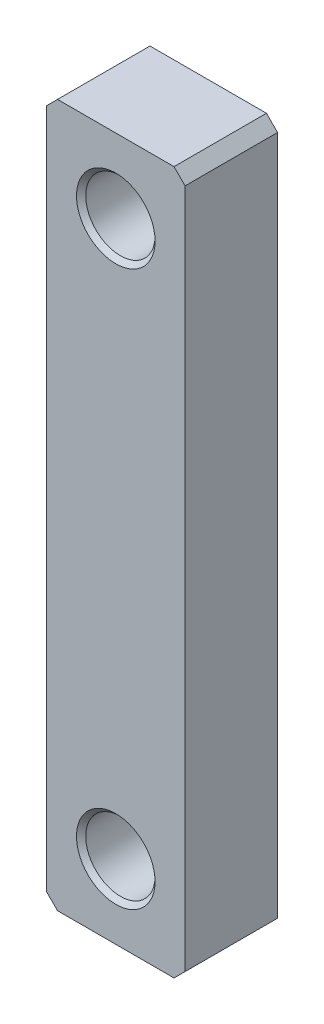
ISO-10303-21;
HEADER;
FILE_DESCRIPTION(('STEP AP214'),'2;1');
FILE_NAME('part.step','',(''),(''),'','','');
FILE_SCHEMA(('AUTOMOTIVE_DESIGN { 1 0 10303 214 1 1 1 1 }'));
ENDSEC;
DATA;
#1=APPLICATION_CONTEXT('core data for automotive mechanical design processes');
#2=APPLICATION_PROTOCOL_DEFINITION('international standard','automotive_design',2000,#1);
#3=PRODUCT_CONTEXT('',#1,'mechanical');
#4=PRODUCT('Part','Part','',(#3));
#5=PRODUCT_RELATED_PRODUCT_CATEGORY('part','',(#4));
#6=PRODUCT_DEFINITION_FORMATION('','',#4);
#7=PRODUCT_DEFINITION_CONTEXT('part definition',#1,'design');
#8=PRODUCT_DEFINITION('design','',#6,#7);
#9=PRODUCT_DEFINITION_SHAPE('','',#8);
#10=(LENGTH_UNIT() NAMED_UNIT(*) SI_UNIT(.MILLI.,.METRE.));
#11=(NAMED_UNIT(*) PLANE_ANGLE_UNIT() SI_UNIT($,.RADIAN.));
#12=(NAMED_UNIT(*) SI_UNIT($,.STERADIAN.) SOLID_ANGLE_UNIT());
#13=UNCERTAINTY_MEASURE_WITH_UNIT(LENGTH_MEASURE(1.E-05),#10,'distance_accuracy_value','');
#14=(GEOMETRIC_REPRESENTATION_CONTEXT(3) GLOBAL_UNCERTAINTY_ASSIGNED_CONTEXT((#13)) GLOBAL_UNIT_ASSIGNED_CONTEXT((#10,
#11,#12)) REPRESENTATION_CONTEXT('',''));
#15=CARTESIAN_POINT('',(0.,0.,0.));
#16=DIRECTION('',(0.,0.,1.));
#17=DIRECTION('',(1.,0.,0.));
#18=AXIS2_PLACEMENT_3D('',#15,#16,#17);
#19=CARTESIAN_POINT('',(-9.52500000000001,48.26,-12.7));
#20=DIRECTION('',(-1.,0.,0.));
#21=DIRECTION('',(0.,-1.,0.));
#22=AXIS2_PLACEMENT_3D('',#19,#20,#21);
#23=PLANE('',#22);
#24=DIRECTION('',(0.,-1.,0.));
#25=VECTOR('',#24,1.);
#26=CARTESIAN_POINT('',(-9.52500000000001,48.26,-12.7));
#27=LINE('',#26,#25);
#28=CARTESIAN_POINT('',(-9.52500000000001,46.736,-12.7));
#29=VERTEX_POINT('',#28);
#30=CARTESIAN_POINT('',(-9.52500000000001,-46.736,-12.7));
#31=VERTEX_POINT('',#30);
#32=EDGE_CURVE('E170',#29,#31,#27,.T.);
#33=ORIENTED_EDGE('',*,*,#32,.T.);
#34=DIRECTION('',(0.,0.,1.));
#35=VECTOR('',#34,1.);
#36=CARTESIAN_POINT('',(-9.525,-46.736,-12.7));
#37=LINE('',#36,#35);
#38=CARTESIAN_POINT('',(-9.52500000000001,-46.736,0.));
#39=VERTEX_POINT('',#38);
#40=EDGE_CURVE('E166',#31,#39,#37,.T.);
#41=ORIENTED_EDGE('',*,*,#40,.T.);
#42=DIRECTION('',(0.,-1.,0.));
#43=VECTOR('',#42,1.);
#44=CARTESIAN_POINT('',(-9.52500000000001,48.26,0.));
#45=LINE('',#44,#43);
#46=CARTESIAN_POINT('',(-9.52500000000001,46.736,0.));
#47=VERTEX_POINT('',#46);
#48=EDGE_CURVE('E119',#47,#39,#45,.T.);
#49=ORIENTED_EDGE('',*,*,#48,.F.);
#50=DIRECTION('',(0.,0.,-1.));
#51=VECTOR('',#50,1.);
#52=CARTESIAN_POINT('',(-9.52500000000001,46.736,-12.7));
#53=LINE('',#52,#51);
#54=EDGE_CURVE('E164',#47,#29,#53,.T.);
#55=ORIENTED_EDGE('',*,*,#54,.T.);
#56=EDGE_LOOP('',(#33,#41,#49,#55));
#57=FACE_BOUND('',#56,.T.);
#58=ADVANCED_FACE('F48',(#57),#23,.T.);
#59=CARTESIAN_POINT('',(-9.52500000000001,48.26,-12.7));
#60=DIRECTION('',(0.,1.,0.));
#61=DIRECTION('',(0.,0.,1.));
#62=AXIS2_PLACEMENT_3D('',#59,#60,#61);
#63=PLANE('',#62);
#64=DIRECTION('',(-1.,0.,0.));
#65=VECTOR('',#64,1.);
#66=CARTESIAN_POINT('',(-9.52500000000001,48.26,-12.7));
#67=LINE('',#66,#65);
#68=CARTESIAN_POINT('',(8.00099999999999,48.26,-12.7));
#69=VERTEX_POINT('',#68);
#70=CARTESIAN_POINT('',(-8.00100000000002,48.26,-12.7));
#71=VERTEX_POINT('',#70);
#72=EDGE_CURVE('E140',#69,#71,#67,.T.);
#73=ORIENTED_EDGE('',*,*,#72,.T.);
#74=DIRECTION('',(0.,0.,1.));
#75=VECTOR('',#74,1.);
#76=CARTESIAN_POINT('',(-8.00100000000002,48.26,-12.7));
#77=LINE('',#76,#75);
#78=CARTESIAN_POINT('',(-8.00100000000001,48.26,0.));
#79=VERTEX_POINT('',#78);
#80=EDGE_CURVE('E13',#71,#79,#77,.T.);
#81=ORIENTED_EDGE('',*,*,#80,.T.);
#82=DIRECTION('',(-1.,0.,0.));
#83=VECTOR('',#82,1.);
#84=CARTESIAN_POINT('',(-9.52500000000001,48.26,0.));
#85=LINE('',#84,#83);
#86=CARTESIAN_POINT('',(8.00099999999998,48.26,0.));
#87=VERTEX_POINT('',#86);
#88=EDGE_CURVE('E172',#87,#79,#85,.T.);
#89=ORIENTED_EDGE('',*,*,#88,.F.);
#90=DIRECTION('',(0.,0.,-1.));
#91=VECTOR('',#90,1.);
#92=CARTESIAN_POINT('',(8.00099999999999,48.26,-12.7));
#93=LINE('',#92,#91);
#94=EDGE_CURVE('E56',#87,#69,#93,.T.);
#95=ORIENTED_EDGE('',*,*,#94,.T.);
#96=EDGE_LOOP('',(#73,#81,#89,#95));
#97=FACE_BOUND('',#96,.T.);
#98=ADVANCED_FACE('F222',(#97),#63,.T.);
#99=CARTESIAN_POINT('',(9.52499999999999,48.26,-12.7));
#100=DIRECTION('',(1.,0.,0.));
#101=DIRECTION('',(0.,1.,0.));
#102=AXIS2_PLACEMENT_3D('',#99,#100,#101);
#103=PLANE('',#102);
#104=DIRECTION('',(0.,1.,0.));
#105=VECTOR('',#104,1.);
#106=CARTESIAN_POINT('',(9.52499999999999,48.26,0.));
#107=LINE('',#106,#105);
#108=CARTESIAN_POINT('',(9.525,-46.736,0.));
#109=VERTEX_POINT('',#108);
#110=CARTESIAN_POINT('',(9.52499999999998,46.736,0.));
#111=VERTEX_POINT('',#110);
#112=EDGE_CURVE('E135',#109,#111,#107,.T.);
#113=ORIENTED_EDGE('',*,*,#112,.F.);
#114=DIRECTION('',(0.,0.,-1.));
#115=VECTOR('',#114,1.);
#116=CARTESIAN_POINT('',(9.525,-46.736,-12.7));
#117=LINE('',#116,#115);
#118=CARTESIAN_POINT('',(9.525,-46.736,-12.7));
#119=VERTEX_POINT('',#118);
#120=EDGE_CURVE('E156',#109,#119,#117,.T.);
#121=ORIENTED_EDGE('',*,*,#120,.T.);
#122=DIRECTION('',(0.,1.,0.));
#123=VECTOR('',#122,1.);
#124=CARTESIAN_POINT('',(9.52499999999999,48.26,-12.7));
#125=LINE('',#124,#123);
#126=CARTESIAN_POINT('',(9.52499999999999,46.736,-12.7));
#127=VERTEX_POINT('',#126);
#128=EDGE_CURVE('E144',#119,#127,#125,.T.);
#129=ORIENTED_EDGE('',*,*,#128,.T.);
#130=DIRECTION('',(0.,0.,1.));
#131=VECTOR('',#130,1.);
#132=CARTESIAN_POINT('',(9.52499999999999,46.736,-12.7));
#133=LINE('',#132,#131);
#134=EDGE_CURVE('E153',#127,#111,#133,.T.);
#135=ORIENTED_EDGE('',*,*,#134,.T.);
#136=EDGE_LOOP('',(#113,#121,#129,#135));
#137=FACE_BOUND('',#136,.T.);
#138=ADVANCED_FACE('F227',(#137),#103,.T.);
#139=CARTESIAN_POINT('',(-9.525,-48.26,-12.7));
#140=DIRECTION('',(0.,-1.,0.));
#141=DIRECTION('',(0.,0.,-1.));
#142=AXIS2_PLACEMENT_3D('',#139,#140,#141);
#143=PLANE('',#142);
#144=DIRECTION('',(1.,0.,0.));
#145=VECTOR('',#144,1.);
#146=CARTESIAN_POINT('',(-9.525,-48.26,-12.7));
#147=LINE('',#146,#145);
#148=CARTESIAN_POINT('',(-8.001,-48.26,-12.7));
#149=VERTEX_POINT('',#148);
#150=CARTESIAN_POINT('',(8.001,-48.26,-12.7));
#151=VERTEX_POINT('',#150);
#152=EDGE_CURVE('E171',#149,#151,#147,.T.);
#153=ORIENTED_EDGE('',*,*,#152,.T.);
#154=DIRECTION('',(0.,0.,1.));
#155=VECTOR('',#154,1.);
#156=CARTESIAN_POINT('',(8.001,-48.26,-12.7));
#157=LINE('',#156,#155);
#158=CARTESIAN_POINT('',(8.00100000000001,-48.26,0.));
#159=VERTEX_POINT('',#158);
#160=EDGE_CURVE('E134',#151,#159,#157,.T.);
#161=ORIENTED_EDGE('',*,*,#160,.T.);
#162=DIRECTION('',(1.,0.,0.));
#163=VECTOR('',#162,1.);
#164=CARTESIAN_POINT('',(-9.525,-48.26,0.));
#165=LINE('',#164,#163);
#166=CARTESIAN_POINT('',(-8.001,-48.26,0.));
#167=VERTEX_POINT('',#166);
#168=EDGE_CURVE('E117',#167,#159,#165,.T.);
#169=ORIENTED_EDGE('',*,*,#168,.F.);
#170=DIRECTION('',(0.,0.,-1.));
#171=VECTOR('',#170,1.);
#172=CARTESIAN_POINT('',(-8.001,-48.26,-12.7));
#173=LINE('',#172,#171);
#174=EDGE_CURVE('E131',#167,#149,#173,.T.);
#175=ORIENTED_EDGE('',*,*,#174,.T.);
#176=EDGE_LOOP('',(#153,#161,#169,#175));
#177=FACE_BOUND('',#176,.T.);
#178=ADVANCED_FACE('F130',(#177),#143,.T.);
#179=CARTESIAN_POINT('',(0.,0.,-12.7));
#180=DIRECTION('',(0.,0.,1.));
#181=DIRECTION('',(1.,0.,0.));
#182=AXIS2_PLACEMENT_3D('',#179,#180,#181);
#183=PLANE('',#182);
#184=CARTESIAN_POINT('',(0.,-38.1,-12.7));
#185=DIRECTION('',(0.,0.,1.));
#186=DIRECTION('',(1.,0.,0.));
#187=AXIS2_PLACEMENT_3D('',#184,#185,#186);
#188=CIRCLE('',#187,4.76249999999999);
#189=CARTESIAN_POINT('',(4.76249999999999,-38.1,-12.7));
#190=VERTEX_POINT('',#189);
#191=EDGE_CURVE('E147',#190,#190,#188,.T.);
#192=ORIENTED_EDGE('',*,*,#191,.T.);
#193=EDGE_LOOP('',(#192));
#194=FACE_BOUND('',#193,.T.);
#195=CARTESIAN_POINT('',(0.,38.1,-12.7));
#196=DIRECTION('',(0.,0.,1.));
#197=DIRECTION('',(1.,0.,0.));
#198=AXIS2_PLACEMENT_3D('',#195,#196,#197);
#199=CIRCLE('',#198,4.76249999999999);
#200=CARTESIAN_POINT('',(4.76249999999999,38.1,-12.7));
#201=VERTEX_POINT('',#200);
#202=EDGE_CURVE('E183',#201,#201,#199,.T.);
#203=ORIENTED_EDGE('',*,*,#202,.T.);
#204=EDGE_LOOP('',(#203));
#205=FACE_BOUND('',#204,.T.);
#206=ORIENTED_EDGE('',*,*,#128,.F.);
#207=DIRECTION('',(0.707106781186547,0.707106781186548,0.));
#208=VECTOR('',#207,1.);
#209=CARTESIAN_POINT('',(8.001,-48.26,-12.7));
#210=LINE('',#209,#208);
#211=EDGE_CURVE('E162',#119,#151,#210,.F.);
#212=ORIENTED_EDGE('',*,*,#211,.T.);
#213=ORIENTED_EDGE('',*,*,#152,.F.);
#214=DIRECTION('',(0.707106781186548,-0.707106781186548,0.));
#215=VECTOR('',#214,1.);
#216=CARTESIAN_POINT('',(-9.525,-46.736,-12.7));
#217=LINE('',#216,#215);
#218=EDGE_CURVE('E139',#149,#31,#217,.F.);
#219=ORIENTED_EDGE('',*,*,#218,.T.);
#220=ORIENTED_EDGE('',*,*,#32,.F.);
#221=DIRECTION('',(-0.707106781186548,-0.707106781186548,0.));
#222=VECTOR('',#221,1.);
#223=CARTESIAN_POINT('',(-8.00100000000002,48.26,-12.7));
#224=LINE('',#223,#222);
#225=EDGE_CURVE('E63',#29,#71,#224,.F.);
#226=ORIENTED_EDGE('',*,*,#225,.T.);
#227=ORIENTED_EDGE('',*,*,#72,.F.);
#228=DIRECTION('',(-0.707106781186548,0.707106781186548,0.));
#229=VECTOR('',#228,1.);
#230=CARTESIAN_POINT('',(9.52499999999999,46.736,-12.7));
#231=LINE('',#230,#229);
#232=EDGE_CURVE('E158',#69,#127,#231,.F.);
#233=ORIENTED_EDGE('',*,*,#232,.T.);
#234=EDGE_LOOP('',(#206,#212,#213,#219,#220,#226,#227,#233));
#235=FACE_BOUND('',#234,.T.);
#236=ADVANCED_FACE('F210',(#194,#205,#235),#183,.F.);
#237=CARTESIAN_POINT('',(0.,0.,0.));
#238=DIRECTION('',(0.,0.,1.));
#239=DIRECTION('',(1.,0.,0.));
#240=AXIS2_PLACEMENT_3D('',#237,#238,#239);
#241=PLANE('',#240);
#242=CARTESIAN_POINT('',(0.,-38.1,0.));
#243=DIRECTION('',(0.,0.,1.));
#244=DIRECTION('',(1.,0.,0.));
#245=AXIS2_PLACEMENT_3D('',#242,#243,#244);
#246=CIRCLE('',#245,5.3975);
#247=CARTESIAN_POINT('',(5.3975,-38.1,0.));
#248=VERTEX_POINT('',#247);
#249=EDGE_CURVE('E201',#248,#248,#246,.T.);
#250=ORIENTED_EDGE('',*,*,#249,.F.);
#251=EDGE_LOOP('',(#250));
#252=FACE_BOUND('',#251,.T.);
#253=CARTESIAN_POINT('',(0.,38.1,0.));
#254=DIRECTION('',(0.,0.,1.));
#255=DIRECTION('',(1.,0.,0.));
#256=AXIS2_PLACEMENT_3D('',#253,#254,#255);
#257=CIRCLE('',#256,5.3975);
#258=CARTESIAN_POINT('',(5.3975,38.1,0.));
#259=VERTEX_POINT('',#258);
#260=EDGE_CURVE('E190',#259,#259,#257,.T.);
#261=ORIENTED_EDGE('',*,*,#260,.F.);
#262=EDGE_LOOP('',(#261));
#263=FACE_BOUND('',#262,.T.);
#264=ORIENTED_EDGE('',*,*,#168,.T.);
#265=DIRECTION('',(-0.707106781186547,-0.707106781186548,0.));
#266=VECTOR('',#265,1.);
#267=CARTESIAN_POINT('',(28.1305,-28.1305,0.));
#268=LINE('',#267,#266);
#269=EDGE_CURVE('E124',#159,#109,#268,.F.);
#270=ORIENTED_EDGE('',*,*,#269,.T.);
#271=ORIENTED_EDGE('',*,*,#112,.T.);
#272=DIRECTION('',(0.707106781186548,-0.707106781186548,0.));
#273=VECTOR('',#272,1.);
#274=CARTESIAN_POINT('',(28.1305,28.1305,0.));
#275=LINE('',#274,#273);
#276=EDGE_CURVE('E142',#111,#87,#275,.F.);
#277=ORIENTED_EDGE('',*,*,#276,.T.);
#278=ORIENTED_EDGE('',*,*,#88,.T.);
#279=DIRECTION('',(0.707106781186548,0.707106781186548,0.));
#280=VECTOR('',#279,1.);
#281=CARTESIAN_POINT('',(-28.1305,28.1305,0.));
#282=LINE('',#281,#280);
#283=EDGE_CURVE('E125',#79,#47,#282,.F.);
#284=ORIENTED_EDGE('',*,*,#283,.T.);
#285=ORIENTED_EDGE('',*,*,#48,.T.);
#286=DIRECTION('',(-0.707106781186548,0.707106781186548,0.));
#287=VECTOR('',#286,1.);
#288=CARTESIAN_POINT('',(-28.1305,-28.1305,0.));
#289=LINE('',#288,#287);
#290=EDGE_CURVE('E114',#39,#167,#289,.F.);
#291=ORIENTED_EDGE('',*,*,#290,.T.);
#292=EDGE_LOOP('',(#264,#270,#271,#277,#278,#284,#285,#291));
#293=FACE_BOUND('',#292,.T.);
#294=ADVANCED_FACE('F116',(#252,#263,#293),#241,.T.);
#295=CARTESIAN_POINT('',(0.,38.1,0.));
#296=DIRECTION('',(0.,0.,1.));
#297=DIRECTION('',(1.,0.,0.));
#298=AXIS2_PLACEMENT_3D('',#295,#296,#297);
#299=CYLINDRICAL_SURFACE('',#298,4.76249999999999);
#300=CARTESIAN_POINT('',(0.,38.1,-0.635000000000004));
#301=DIRECTION('',(0.,0.,1.));
#302=DIRECTION('',(1.,0.,0.));
#303=AXIS2_PLACEMENT_3D('',#300,#301,#302);
#304=CIRCLE('',#303,4.76249999999999);
#305=CARTESIAN_POINT('',(4.76249999999999,38.1,-0.635000000000004));
#306=VERTEX_POINT('',#305);
#307=EDGE_CURVE('E178',#306,#306,#304,.T.);
#308=ORIENTED_EDGE('',*,*,#307,.T.);
#309=EDGE_LOOP('',(#308));
#310=FACE_BOUND('',#309,.T.);
#311=ORIENTED_EDGE('',*,*,#202,.F.);
#312=EDGE_LOOP('',(#311));
#313=FACE_BOUND('',#312,.T.);
#314=ADVANCED_FACE('F209',(#310,#313),#299,.F.);
#315=CARTESIAN_POINT('',(0.,38.1,0.));
#316=DIRECTION('',(0.,0.,1.));
#317=DIRECTION('',(1.,0.,0.));
#318=AXIS2_PLACEMENT_3D('',#315,#316,#317);
#319=CONICAL_SURFACE('',#318,5.3975,0.785398163397449);
#320=ORIENTED_EDGE('',*,*,#307,.F.);
#321=EDGE_LOOP('',(#320));
#322=FACE_BOUND('',#321,.T.);
#323=ORIENTED_EDGE('',*,*,#260,.T.);
#324=EDGE_LOOP('',(#323));
#325=FACE_BOUND('',#324,.T.);
#326=ADVANCED_FACE('F216',(#322,#325),#319,.F.);
#327=CARTESIAN_POINT('',(0.,-38.1,0.));
#328=DIRECTION('',(0.,0.,1.));
#329=DIRECTION('',(1.,0.,0.));
#330=AXIS2_PLACEMENT_3D('',#327,#328,#329);
#331=CYLINDRICAL_SURFACE('',#330,4.76249999999999);
#332=CARTESIAN_POINT('',(0.,-38.1,-0.635000000000004));
#333=DIRECTION('',(0.,0.,1.));
#334=DIRECTION('',(1.,0.,0.));
#335=AXIS2_PLACEMENT_3D('',#332,#333,#334);
#336=CIRCLE('',#335,4.76249999999999);
#337=CARTESIAN_POINT('',(4.76249999999999,-38.1,-0.635000000000004));
#338=VERTEX_POINT('',#337);
#339=EDGE_CURVE('E197',#338,#338,#336,.T.);
#340=ORIENTED_EDGE('',*,*,#339,.T.);
#341=EDGE_LOOP('',(#340));
#342=FACE_BOUND('',#341,.T.);
#343=ORIENTED_EDGE('',*,*,#191,.F.);
#344=EDGE_LOOP('',(#343));
#345=FACE_BOUND('',#344,.T.);
#346=ADVANCED_FACE('F297',(#342,#345),#331,.F.);
#347=CARTESIAN_POINT('',(0.,-38.1,0.));
#348=DIRECTION('',(0.,0.,1.));
#349=DIRECTION('',(1.,0.,0.));
#350=AXIS2_PLACEMENT_3D('',#347,#348,#349);
#351=CONICAL_SURFACE('',#350,5.3975,0.785398163397449);
#352=ORIENTED_EDGE('',*,*,#339,.F.);
#353=EDGE_LOOP('',(#352));
#354=FACE_BOUND('',#353,.T.);
#355=ORIENTED_EDGE('',*,*,#249,.T.);
#356=EDGE_LOOP('',(#355));
#357=FACE_BOUND('',#356,.T.);
#358=ADVANCED_FACE('F205',(#354,#357),#351,.F.);
#359=CARTESIAN_POINT('',(8.001,-48.26,-12.7));
#360=DIRECTION('',(-0.707106781186548,0.707106781186547,0.));
#361=DIRECTION('',(0.,0.,1.));
#362=AXIS2_PLACEMENT_3D('',#359,#360,#361);
#363=PLANE('',#362);
#364=ORIENTED_EDGE('',*,*,#211,.F.);
#365=ORIENTED_EDGE('',*,*,#120,.F.);
#366=ORIENTED_EDGE('',*,*,#269,.F.);
#367=ORIENTED_EDGE('',*,*,#160,.F.);
#368=EDGE_LOOP('',(#364,#365,#366,#367));
#369=FACE_BOUND('',#368,.T.);
#370=ADVANCED_FACE('F231',(#369),#363,.F.);
#371=CARTESIAN_POINT('',(-9.525,-46.736,-12.7));
#372=DIRECTION('',(0.707106781186548,0.707106781186548,0.));
#373=DIRECTION('',(0.,0.,1.));
#374=AXIS2_PLACEMENT_3D('',#371,#372,#373);
#375=PLANE('',#374);
#376=ORIENTED_EDGE('',*,*,#218,.F.);
#377=ORIENTED_EDGE('',*,*,#174,.F.);
#378=ORIENTED_EDGE('',*,*,#290,.F.);
#379=ORIENTED_EDGE('',*,*,#40,.F.);
#380=EDGE_LOOP('',(#376,#377,#378,#379));
#381=FACE_BOUND('',#380,.T.);
#382=ADVANCED_FACE('F138',(#381),#375,.F.);
#383=CARTESIAN_POINT('',(-8.00100000000002,48.26,-12.7));
#384=DIRECTION('',(0.707106781186548,-0.707106781186548,0.));
#385=DIRECTION('',(0.,0.,1.));
#386=AXIS2_PLACEMENT_3D('',#383,#384,#385);
#387=PLANE('',#386);
#388=ORIENTED_EDGE('',*,*,#225,.F.);
#389=ORIENTED_EDGE('',*,*,#54,.F.);
#390=ORIENTED_EDGE('',*,*,#283,.F.);
#391=ORIENTED_EDGE('',*,*,#80,.F.);
#392=EDGE_LOOP('',(#388,#389,#390,#391));
#393=FACE_BOUND('',#392,.T.);
#394=ADVANCED_FACE('F236',(#393),#387,.F.);
#395=CARTESIAN_POINT('',(9.52499999999999,46.736,-12.7));
#396=DIRECTION('',(-0.707106781186548,-0.707106781186548,0.));
#397=DIRECTION('',(0.,0.,1.));
#398=AXIS2_PLACEMENT_3D('',#395,#396,#397);
#399=PLANE('',#398);
#400=ORIENTED_EDGE('',*,*,#232,.F.);
#401=ORIENTED_EDGE('',*,*,#94,.F.);
#402=ORIENTED_EDGE('',*,*,#276,.F.);
#403=ORIENTED_EDGE('',*,*,#134,.F.);
#404=EDGE_LOOP('',(#400,#401,#402,#403));
#405=FACE_BOUND('',#404,.T.);
#406=ADVANCED_FACE('F50',(#405),#399,.F.);
#407=CLOSED_SHELL('',(#58,#98,#138,#178,#236,#294,#314,#326,#346,#358,#370,#382,#394,#406));
#408=MANIFOLD_SOLID_BREP('B2',#407);
#409=ADVANCED_BREP_SHAPE_REPRESENTATION('',(#18,#408),#14);
#410=SHAPE_DEFINITION_REPRESENTATION(#9,#409);
ENDSEC;
END-ISO-10303-21;
